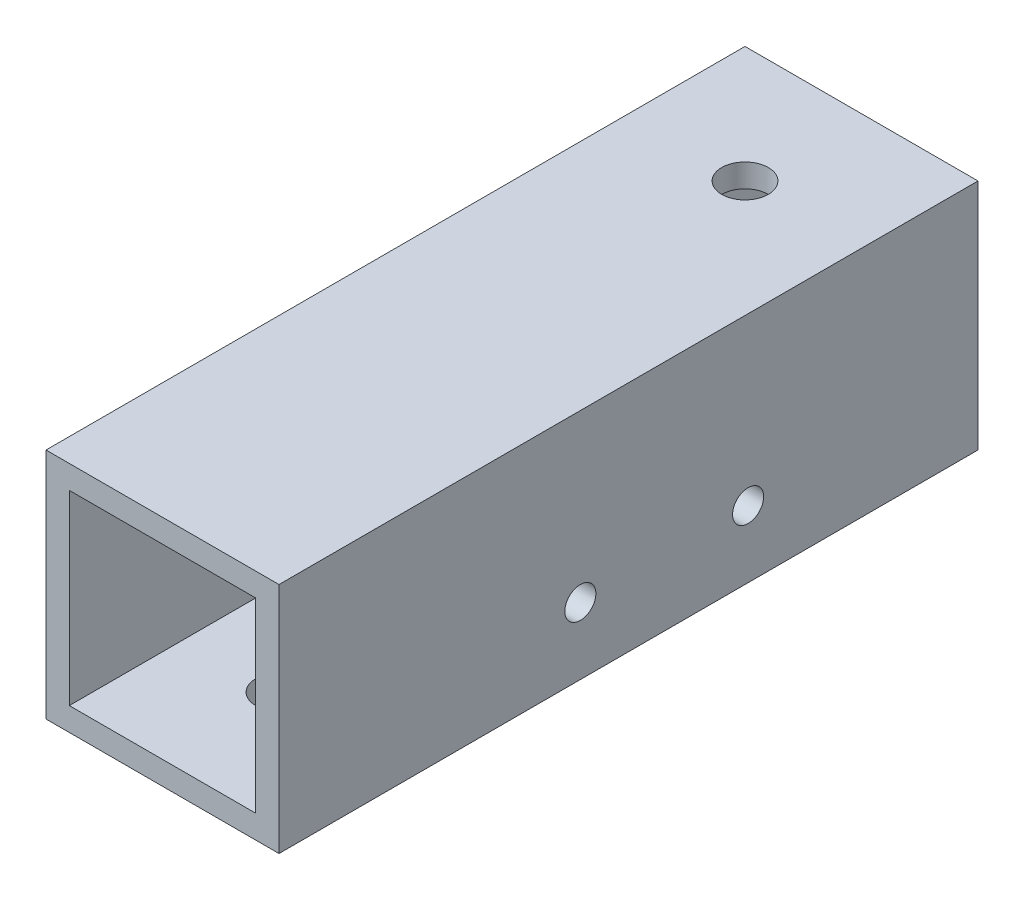
ISO-10303-21;
HEADER;
FILE_DESCRIPTION(('STEP AP214'),'2;1');
FILE_NAME('part.step','',(''),(''),'','','');
FILE_SCHEMA(('AUTOMOTIVE_DESIGN { 1 0 10303 214 1 1 1 1 }'));
ENDSEC;
DATA;
#1=APPLICATION_CONTEXT('core data for automotive mechanical design processes');
#2=APPLICATION_PROTOCOL_DEFINITION('international standard','automotive_design',2000,#1);
#3=PRODUCT_CONTEXT('',#1,'mechanical');
#4=PRODUCT('Part','Part','',(#3));
#5=PRODUCT_RELATED_PRODUCT_CATEGORY('part','',(#4));
#6=PRODUCT_DEFINITION_FORMATION('','',#4);
#7=PRODUCT_DEFINITION_CONTEXT('part definition',#1,'design');
#8=PRODUCT_DEFINITION('design','',#6,#7);
#9=PRODUCT_DEFINITION_SHAPE('','',#8);
#10=(LENGTH_UNIT() NAMED_UNIT(*) SI_UNIT(.MILLI.,.METRE.));
#11=(NAMED_UNIT(*) PLANE_ANGLE_UNIT() SI_UNIT($,.RADIAN.));
#12=(NAMED_UNIT(*) SI_UNIT($,.STERADIAN.) SOLID_ANGLE_UNIT());
#13=UNCERTAINTY_MEASURE_WITH_UNIT(LENGTH_MEASURE(1.E-05),#10,'distance_accuracy_value','');
#14=(GEOMETRIC_REPRESENTATION_CONTEXT(3) GLOBAL_UNCERTAINTY_ASSIGNED_CONTEXT((#13)) GLOBAL_UNIT_ASSIGNED_CONTEXT((#10,
#11,#12)) REPRESENTATION_CONTEXT('',''));
#15=CARTESIAN_POINT('',(0.,0.,0.));
#16=DIRECTION('',(0.,0.,1.));
#17=DIRECTION('',(1.,0.,0.));
#18=AXIS2_PLACEMENT_3D('',#15,#16,#17);
#19=CARTESIAN_POINT('',(0.,0.,45.));
#20=DIRECTION('',(0.,0.,1.));
#21=DIRECTION('',(1.,0.,0.));
#22=AXIS2_PLACEMENT_3D('',#19,#20,#21);
#23=PLANE('',#22);
#24=DIRECTION('',(0.,-1.,0.));
#25=VECTOR('',#24,1.);
#26=CARTESIAN_POINT('',(-7.01008414074451,7.73262608579252,45.));
#27=LINE('',#26,#25);
#28=CARTESIAN_POINT('',(-7.01008414074451,7.73262608579252,45.));
#29=VERTEX_POINT('',#28);
#30=CARTESIAN_POINT('',(-7.01008414074451,-7.26737391420748,45.));
#31=VERTEX_POINT('',#30);
#32=EDGE_CURVE('E138',#29,#31,#27,.T.);
#33=ORIENTED_EDGE('',*,*,#32,.T.);
#34=DIRECTION('',(1.,0.,0.));
#35=VECTOR('',#34,1.);
#36=CARTESIAN_POINT('',(-7.01008414074451,-7.26737391420748,45.));
#37=LINE('',#36,#35);
#38=CARTESIAN_POINT('',(7.98991585925548,-7.26737391420748,45.));
#39=VERTEX_POINT('',#38);
#40=EDGE_CURVE('E141',#31,#39,#37,.T.);
#41=ORIENTED_EDGE('',*,*,#40,.T.);
#42=DIRECTION('',(0.,1.,0.));
#43=VECTOR('',#42,1.);
#44=CARTESIAN_POINT('',(7.98991585925549,7.73262608579252,45.));
#45=LINE('',#44,#43);
#46=CARTESIAN_POINT('',(7.98991585925549,7.73262608579252,45.));
#47=VERTEX_POINT('',#46);
#48=EDGE_CURVE('E144',#39,#47,#45,.T.);
#49=ORIENTED_EDGE('',*,*,#48,.T.);
#50=DIRECTION('',(-1.,0.,0.));
#51=VECTOR('',#50,1.);
#52=CARTESIAN_POINT('',(-7.01008414074451,7.73262608579252,45.));
#53=LINE('',#52,#51);
#54=EDGE_CURVE('E146',#47,#29,#53,.T.);
#55=ORIENTED_EDGE('',*,*,#54,.T.);
#56=EDGE_LOOP('',(#33,#41,#49,#55));
#57=FACE_BOUND('',#56,.T.);
#58=DIRECTION('',(1.,0.,0.));
#59=VECTOR('',#58,1.);
#60=CARTESIAN_POINT('',(-5.51008414074451,-5.76737391420748,45.));
#61=LINE('',#60,#59);
#62=CARTESIAN_POINT('',(-5.51008414074451,-5.76737391420748,45.));
#63=VERTEX_POINT('',#62);
#64=CARTESIAN_POINT('',(6.48991585925549,-5.76737391420748,45.));
#65=VERTEX_POINT('',#64);
#66=EDGE_CURVE('E108',#63,#65,#61,.T.);
#67=ORIENTED_EDGE('',*,*,#66,.F.);
#68=DIRECTION('',(0.,-1.,0.));
#69=VECTOR('',#68,1.);
#70=CARTESIAN_POINT('',(-5.51008414074451,6.23262608579252,45.));
#71=LINE('',#70,#69);
#72=CARTESIAN_POINT('',(-5.51008414074451,6.23262608579252,45.));
#73=VERTEX_POINT('',#72);
#74=EDGE_CURVE('E100',#73,#63,#71,.T.);
#75=ORIENTED_EDGE('',*,*,#74,.F.);
#76=DIRECTION('',(-1.,0.,0.));
#77=VECTOR('',#76,1.);
#78=CARTESIAN_POINT('',(-5.51008414074451,6.23262608579252,45.));
#79=LINE('',#78,#77);
#80=CARTESIAN_POINT('',(6.48991585925549,6.23262608579252,45.));
#81=VERTEX_POINT('',#80);
#82=EDGE_CURVE('E122',#81,#73,#79,.T.);
#83=ORIENTED_EDGE('',*,*,#82,.F.);
#84=DIRECTION('',(0.,1.,0.));
#85=VECTOR('',#84,1.);
#86=CARTESIAN_POINT('',(6.48991585925549,6.23262608579252,45.));
#87=LINE('',#86,#85);
#88=EDGE_CURVE('E120',#65,#81,#87,.T.);
#89=ORIENTED_EDGE('',*,*,#88,.F.);
#90=EDGE_LOOP('',(#67,#75,#83,#89));
#91=FACE_BOUND('',#90,.T.);
#92=ADVANCED_FACE('F33',(#57,#91),#23,.T.);
#93=CARTESIAN_POINT('',(0.,0.,0.));
#94=DIRECTION('',(0.,0.,1.));
#95=DIRECTION('',(1.,0.,0.));
#96=AXIS2_PLACEMENT_3D('',#93,#94,#95);
#97=PLANE('',#96);
#98=DIRECTION('',(0.,-1.,0.));
#99=VECTOR('',#98,1.);
#100=CARTESIAN_POINT('',(-7.01008414074451,7.73262608579252,0.));
#101=LINE('',#100,#99);
#102=CARTESIAN_POINT('',(-7.01008414074451,7.73262608579252,0.));
#103=VERTEX_POINT('',#102);
#104=CARTESIAN_POINT('',(-7.01008414074451,-7.26737391420748,0.));
#105=VERTEX_POINT('',#104);
#106=EDGE_CURVE('E116',#103,#105,#101,.T.);
#107=ORIENTED_EDGE('',*,*,#106,.F.);
#108=DIRECTION('',(-1.,0.,0.));
#109=VECTOR('',#108,1.);
#110=CARTESIAN_POINT('',(-7.01008414074451,7.73262608579252,0.));
#111=LINE('',#110,#109);
#112=CARTESIAN_POINT('',(7.98991585925549,7.73262608579252,0.));
#113=VERTEX_POINT('',#112);
#114=EDGE_CURVE('E142',#113,#103,#111,.T.);
#115=ORIENTED_EDGE('',*,*,#114,.F.);
#116=DIRECTION('',(0.,1.,0.));
#117=VECTOR('',#116,1.);
#118=CARTESIAN_POINT('',(7.98991585925549,7.73262608579252,0.));
#119=LINE('',#118,#117);
#120=CARTESIAN_POINT('',(7.98991585925548,-7.26737391420748,0.));
#121=VERTEX_POINT('',#120);
#122=EDGE_CURVE('E153',#121,#113,#119,.T.);
#123=ORIENTED_EDGE('',*,*,#122,.F.);
#124=DIRECTION('',(1.,0.,0.));
#125=VECTOR('',#124,1.);
#126=CARTESIAN_POINT('',(-7.01008414074451,-7.26737391420748,0.));
#127=LINE('',#126,#125);
#128=EDGE_CURVE('E151',#105,#121,#127,.T.);
#129=ORIENTED_EDGE('',*,*,#128,.F.);
#130=EDGE_LOOP('',(#107,#115,#123,#129));
#131=FACE_BOUND('',#130,.T.);
#132=DIRECTION('',(0.,-1.,0.));
#133=VECTOR('',#132,1.);
#134=CARTESIAN_POINT('',(-5.51008414074451,6.23262608579252,0.));
#135=LINE('',#134,#133);
#136=CARTESIAN_POINT('',(-5.51008414074451,6.23262608579252,0.));
#137=VERTEX_POINT('',#136);
#138=CARTESIAN_POINT('',(-5.51008414074451,-5.76737391420748,0.));
#139=VERTEX_POINT('',#138);
#140=EDGE_CURVE('E58',#137,#139,#135,.T.);
#141=ORIENTED_EDGE('',*,*,#140,.T.);
#142=DIRECTION('',(1.,0.,0.));
#143=VECTOR('',#142,1.);
#144=CARTESIAN_POINT('',(-5.51008414074451,-5.76737391420748,0.));
#145=LINE('',#144,#143);
#146=CARTESIAN_POINT('',(6.48991585925549,-5.76737391420748,0.));
#147=VERTEX_POINT('',#146);
#148=EDGE_CURVE('E115',#139,#147,#145,.T.);
#149=ORIENTED_EDGE('',*,*,#148,.T.);
#150=DIRECTION('',(0.,1.,0.));
#151=VECTOR('',#150,1.);
#152=CARTESIAN_POINT('',(6.48991585925549,6.23262608579252,0.));
#153=LINE('',#152,#151);
#154=CARTESIAN_POINT('',(6.48991585925549,6.23262608579252,0.));
#155=VERTEX_POINT('',#154);
#156=EDGE_CURVE('E130',#147,#155,#153,.T.);
#157=ORIENTED_EDGE('',*,*,#156,.T.);
#158=DIRECTION('',(-1.,0.,0.));
#159=VECTOR('',#158,1.);
#160=CARTESIAN_POINT('',(-5.51008414074451,6.23262608579252,0.));
#161=LINE('',#160,#159);
#162=EDGE_CURVE('E109',#155,#137,#161,.T.);
#163=ORIENTED_EDGE('',*,*,#162,.T.);
#164=EDGE_LOOP('',(#141,#149,#157,#163));
#165=FACE_BOUND('',#164,.T.);
#166=ADVANCED_FACE('F203',(#131,#165),#97,.F.);
#167=CARTESIAN_POINT('',(-7.01008414074451,7.73262608579252,45.));
#168=DIRECTION('',(1.,0.,0.));
#169=DIRECTION('',(0.,1.,0.));
#170=AXIS2_PLACEMENT_3D('',#167,#168,#169);
#171=PLANE('',#170);
#172=ORIENTED_EDGE('',*,*,#106,.T.);
#173=DIRECTION('',(0.,0.,-1.));
#174=VECTOR('',#173,1.);
#175=CARTESIAN_POINT('',(-7.01008414074451,-7.26737391420748,45.));
#176=LINE('',#175,#174);
#177=EDGE_CURVE('E11',#31,#105,#176,.T.);
#178=ORIENTED_EDGE('',*,*,#177,.F.);
#179=ORIENTED_EDGE('',*,*,#32,.F.);
#180=DIRECTION('',(0.,0.,-1.));
#181=VECTOR('',#180,1.);
#182=CARTESIAN_POINT('',(-7.01008414074451,7.73262608579252,45.));
#183=LINE('',#182,#181);
#184=EDGE_CURVE('E148',#29,#103,#183,.T.);
#185=ORIENTED_EDGE('',*,*,#184,.T.);
#186=EDGE_LOOP('',(#172,#178,#179,#185));
#187=FACE_BOUND('',#186,.T.);
#188=ADVANCED_FACE('F35',(#187),#171,.F.);
#189=CARTESIAN_POINT('',(-7.01008414074451,-7.26737391420748,45.));
#190=DIRECTION('',(0.,1.,0.));
#191=DIRECTION('',(0.,0.,1.));
#192=AXIS2_PLACEMENT_3D('',#189,#190,#191);
#193=PLANE('',#192);
#194=CARTESIAN_POINT('',(0.489915859255484,-7.26737391420748,37.5));
#195=DIRECTION('',(0.,-1.,0.));
#196=DIRECTION('',(0.,0.,-1.));
#197=AXIS2_PLACEMENT_3D('',#194,#195,#196);
#198=CIRCLE('',#197,1.5);
#199=CARTESIAN_POINT('',(0.489915859255484,-7.26737391420748,36.));
#200=VERTEX_POINT('',#199);
#201=EDGE_CURVE('E168',#200,#200,#198,.T.);
#202=ORIENTED_EDGE('',*,*,#201,.F.);
#203=EDGE_LOOP('',(#202));
#204=FACE_BOUND('',#203,.T.);
#205=ORIENTED_EDGE('',*,*,#128,.T.);
#206=DIRECTION('',(0.,0.,-1.));
#207=VECTOR('',#206,1.);
#208=CARTESIAN_POINT('',(7.98991585925548,-7.26737391420748,45.));
#209=LINE('',#208,#207);
#210=EDGE_CURVE('E42',#39,#121,#209,.T.);
#211=ORIENTED_EDGE('',*,*,#210,.F.);
#212=ORIENTED_EDGE('',*,*,#40,.F.);
#213=ORIENTED_EDGE('',*,*,#177,.T.);
#214=EDGE_LOOP('',(#205,#211,#212,#213));
#215=FACE_BOUND('',#214,.T.);
#216=ADVANCED_FACE('F207',(#204,#215),#193,.F.);
#217=CARTESIAN_POINT('',(7.98991585925549,7.73262608579252,45.));
#218=DIRECTION('',(-1.,0.,0.));
#219=DIRECTION('',(0.,-1.,0.));
#220=AXIS2_PLACEMENT_3D('',#217,#218,#219);
#221=PLANE('',#220);
#222=CARTESIAN_POINT('',(7.98991585925548,-2.96737391420748,14.8));
#223=DIRECTION('',(1.,0.,0.));
#224=DIRECTION('',(0.,1.,0.));
#225=AXIS2_PLACEMENT_3D('',#222,#223,#224);
#226=CIRCLE('',#225,1.);
#227=CARTESIAN_POINT('',(7.98991585925548,-1.96737391420748,14.8));
#228=VERTEX_POINT('',#227);
#229=EDGE_CURVE('E181',#228,#228,#226,.T.);
#230=ORIENTED_EDGE('',*,*,#229,.F.);
#231=EDGE_LOOP('',(#230));
#232=FACE_BOUND('',#231,.T.);
#233=CARTESIAN_POINT('',(7.98991585925548,-2.96737391420748,25.6));
#234=DIRECTION('',(1.,0.,0.));
#235=DIRECTION('',(0.,1.,0.));
#236=AXIS2_PLACEMENT_3D('',#233,#234,#235);
#237=CIRCLE('',#236,0.999999999999998);
#238=CARTESIAN_POINT('',(7.98991585925548,-1.96737391420748,25.6));
#239=VERTEX_POINT('',#238);
#240=EDGE_CURVE('E171',#239,#239,#237,.T.);
#241=ORIENTED_EDGE('',*,*,#240,.F.);
#242=EDGE_LOOP('',(#241));
#243=FACE_BOUND('',#242,.T.);
#244=ORIENTED_EDGE('',*,*,#122,.T.);
#245=DIRECTION('',(0.,0.,-1.));
#246=VECTOR('',#245,1.);
#247=CARTESIAN_POINT('',(7.98991585925549,7.73262608579252,45.));
#248=LINE('',#247,#246);
#249=EDGE_CURVE('E158',#47,#113,#248,.T.);
#250=ORIENTED_EDGE('',*,*,#249,.F.);
#251=ORIENTED_EDGE('',*,*,#48,.F.);
#252=ORIENTED_EDGE('',*,*,#210,.T.);
#253=EDGE_LOOP('',(#244,#250,#251,#252));
#254=FACE_BOUND('',#253,.T.);
#255=ADVANCED_FACE('F191',(#232,#243,#254),#221,.F.);
#256=CARTESIAN_POINT('',(-7.01008414074451,7.73262608579252,45.));
#257=DIRECTION('',(0.,-1.,0.));
#258=DIRECTION('',(0.,0.,-1.));
#259=AXIS2_PLACEMENT_3D('',#256,#257,#258);
#260=PLANE('',#259);
#261=CARTESIAN_POINT('',(0.489915859255487,7.73262608579252,7.5));
#262=DIRECTION('',(0.,1.,0.));
#263=DIRECTION('',(0.,0.,1.));
#264=AXIS2_PLACEMENT_3D('',#261,#262,#263);
#265=CIRCLE('',#264,1.5);
#266=CARTESIAN_POINT('',(0.489915859255487,7.73262608579252,9.));
#267=VERTEX_POINT('',#266);
#268=EDGE_CURVE('E165',#267,#267,#265,.T.);
#269=ORIENTED_EDGE('',*,*,#268,.F.);
#270=EDGE_LOOP('',(#269));
#271=FACE_BOUND('',#270,.T.);
#272=ORIENTED_EDGE('',*,*,#114,.T.);
#273=ORIENTED_EDGE('',*,*,#184,.F.);
#274=ORIENTED_EDGE('',*,*,#54,.F.);
#275=ORIENTED_EDGE('',*,*,#249,.T.);
#276=EDGE_LOOP('',(#272,#273,#274,#275));
#277=FACE_BOUND('',#276,.T.);
#278=ADVANCED_FACE('F188',(#271,#277),#260,.F.);
#279=CARTESIAN_POINT('',(-5.51008414074451,6.23262608579252,45.));
#280=DIRECTION('',(1.,0.,0.));
#281=DIRECTION('',(0.,1.,0.));
#282=AXIS2_PLACEMENT_3D('',#279,#280,#281);
#283=PLANE('',#282);
#284=ORIENTED_EDGE('',*,*,#140,.F.);
#285=DIRECTION('',(0.,0.,-1.));
#286=VECTOR('',#285,1.);
#287=CARTESIAN_POINT('',(-5.51008414074451,6.23262608579252,45.));
#288=LINE('',#287,#286);
#289=EDGE_CURVE('E104',#73,#137,#288,.T.);
#290=ORIENTED_EDGE('',*,*,#289,.F.);
#291=ORIENTED_EDGE('',*,*,#74,.T.);
#292=DIRECTION('',(0.,0.,-1.));
#293=VECTOR('',#292,1.);
#294=CARTESIAN_POINT('',(-5.51008414074451,-5.76737391420748,45.));
#295=LINE('',#294,#293);
#296=EDGE_CURVE('E103',#63,#139,#295,.T.);
#297=ORIENTED_EDGE('',*,*,#296,.T.);
#298=EDGE_LOOP('',(#284,#290,#291,#297));
#299=FACE_BOUND('',#298,.T.);
#300=ADVANCED_FACE('F102',(#299),#283,.T.);
#301=CARTESIAN_POINT('',(-5.51008414074451,-5.76737391420748,45.));
#302=DIRECTION('',(0.,1.,0.));
#303=DIRECTION('',(0.,0.,1.));
#304=AXIS2_PLACEMENT_3D('',#301,#302,#303);
#305=PLANE('',#304);
#306=CARTESIAN_POINT('',(0.489915859255484,-5.76737391420748,37.5));
#307=DIRECTION('',(0.,1.,0.));
#308=DIRECTION('',(0.,0.,1.));
#309=AXIS2_PLACEMENT_3D('',#306,#307,#308);
#310=CIRCLE('',#309,1.5);
#311=CARTESIAN_POINT('',(0.489915859255484,-5.76737391420748,39.));
#312=VERTEX_POINT('',#311);
#313=EDGE_CURVE('E166',#312,#312,#310,.T.);
#314=ORIENTED_EDGE('',*,*,#313,.F.);
#315=EDGE_LOOP('',(#314));
#316=FACE_BOUND('',#315,.T.);
#317=ORIENTED_EDGE('',*,*,#148,.F.);
#318=ORIENTED_EDGE('',*,*,#296,.F.);
#319=ORIENTED_EDGE('',*,*,#66,.T.);
#320=DIRECTION('',(0.,0.,-1.));
#321=VECTOR('',#320,1.);
#322=CARTESIAN_POINT('',(6.48991585925549,-5.76737391420748,45.));
#323=LINE('',#322,#321);
#324=EDGE_CURVE('E117',#65,#147,#323,.T.);
#325=ORIENTED_EDGE('',*,*,#324,.T.);
#326=EDGE_LOOP('',(#317,#318,#319,#325));
#327=FACE_BOUND('',#326,.T.);
#328=ADVANCED_FACE('F112',(#316,#327),#305,.T.);
#329=CARTESIAN_POINT('',(6.48991585925549,6.23262608579252,45.));
#330=DIRECTION('',(-1.,0.,0.));
#331=DIRECTION('',(0.,-1.,0.));
#332=AXIS2_PLACEMENT_3D('',#329,#330,#331);
#333=PLANE('',#332);
#334=CARTESIAN_POINT('',(6.48991585925549,-2.96737391420748,14.8));
#335=DIRECTION('',(-1.,0.,0.));
#336=DIRECTION('',(0.,-1.,0.));
#337=AXIS2_PLACEMENT_3D('',#334,#335,#336);
#338=CIRCLE('',#337,1.);
#339=CARTESIAN_POINT('',(6.48991585925549,-3.96737391420748,14.8));
#340=VERTEX_POINT('',#339);
#341=EDGE_CURVE('E37',#340,#340,#338,.T.);
#342=ORIENTED_EDGE('',*,*,#341,.F.);
#343=EDGE_LOOP('',(#342));
#344=FACE_BOUND('',#343,.T.);
#345=CARTESIAN_POINT('',(6.48991585925549,-2.96737391420748,25.6));
#346=DIRECTION('',(-1.,0.,0.));
#347=DIRECTION('',(0.,-1.,0.));
#348=AXIS2_PLACEMENT_3D('',#345,#346,#347);
#349=CIRCLE('',#348,0.999999999999998);
#350=CARTESIAN_POINT('',(6.48991585925549,-3.96737391420748,25.6));
#351=VERTEX_POINT('',#350);
#352=EDGE_CURVE('E169',#351,#351,#349,.T.);
#353=ORIENTED_EDGE('',*,*,#352,.F.);
#354=EDGE_LOOP('',(#353));
#355=FACE_BOUND('',#354,.T.);
#356=ORIENTED_EDGE('',*,*,#156,.F.);
#357=ORIENTED_EDGE('',*,*,#324,.F.);
#358=ORIENTED_EDGE('',*,*,#88,.T.);
#359=DIRECTION('',(0.,0.,-1.));
#360=VECTOR('',#359,1.);
#361=CARTESIAN_POINT('',(6.48991585925549,6.23262608579252,45.));
#362=LINE('',#361,#360);
#363=EDGE_CURVE('E50',#81,#155,#362,.T.);
#364=ORIENTED_EDGE('',*,*,#363,.T.);
#365=EDGE_LOOP('',(#356,#357,#358,#364));
#366=FACE_BOUND('',#365,.T.);
#367=ADVANCED_FACE('F231',(#344,#355,#366),#333,.T.);
#368=CARTESIAN_POINT('',(-5.51008414074451,6.23262608579252,45.));
#369=DIRECTION('',(0.,-1.,0.));
#370=DIRECTION('',(0.,0.,-1.));
#371=AXIS2_PLACEMENT_3D('',#368,#369,#370);
#372=PLANE('',#371);
#373=CARTESIAN_POINT('',(0.489915859255487,6.23262608579252,7.5));
#374=DIRECTION('',(0.,-1.,0.));
#375=DIRECTION('',(0.,0.,-1.));
#376=AXIS2_PLACEMENT_3D('',#373,#374,#375);
#377=CIRCLE('',#376,1.5);
#378=CARTESIAN_POINT('',(0.489915859255487,6.23262608579252,6.));
#379=VERTEX_POINT('',#378);
#380=EDGE_CURVE('E128',#379,#379,#377,.T.);
#381=ORIENTED_EDGE('',*,*,#380,.F.);
#382=EDGE_LOOP('',(#381));
#383=FACE_BOUND('',#382,.T.);
#384=ORIENTED_EDGE('',*,*,#162,.F.);
#385=ORIENTED_EDGE('',*,*,#363,.F.);
#386=ORIENTED_EDGE('',*,*,#82,.T.);
#387=ORIENTED_EDGE('',*,*,#289,.T.);
#388=EDGE_LOOP('',(#384,#385,#386,#387));
#389=FACE_BOUND('',#388,.T.);
#390=ADVANCED_FACE('F235',(#383,#389),#372,.T.);
#391=CARTESIAN_POINT('',(0.489915859255487,-2.26737391420748,7.5));
#392=DIRECTION('',(0.,1.,0.));
#393=DIRECTION('',(0.,0.,1.));
#394=AXIS2_PLACEMENT_3D('',#391,#392,#393);
#395=CYLINDRICAL_SURFACE('',#394,1.5);
#396=ORIENTED_EDGE('',*,*,#380,.T.);
#397=EDGE_LOOP('',(#396));
#398=FACE_BOUND('',#397,.T.);
#399=ORIENTED_EDGE('',*,*,#268,.T.);
#400=EDGE_LOOP('',(#399));
#401=FACE_BOUND('',#400,.T.);
#402=ADVANCED_FACE('F186',(#398,#401),#395,.F.);
#403=CARTESIAN_POINT('',(0.489915859255484,2.73262608579252,37.5));
#404=DIRECTION('',(0.,-1.,0.));
#405=DIRECTION('',(0.,0.,-1.));
#406=AXIS2_PLACEMENT_3D('',#403,#404,#405);
#407=CYLINDRICAL_SURFACE('',#406,1.5);
#408=ORIENTED_EDGE('',*,*,#313,.T.);
#409=EDGE_LOOP('',(#408));
#410=FACE_BOUND('',#409,.T.);
#411=ORIENTED_EDGE('',*,*,#201,.T.);
#412=EDGE_LOOP('',(#411));
#413=FACE_BOUND('',#412,.T.);
#414=ADVANCED_FACE('F242',(#410,#413),#407,.F.);
#415=CARTESIAN_POINT('',(-2.01008414074452,-2.96737391420748,25.6));
#416=DIRECTION('',(1.,0.,0.));
#417=DIRECTION('',(0.,1.,0.));
#418=AXIS2_PLACEMENT_3D('',#415,#416,#417);
#419=CYLINDRICAL_SURFACE('',#418,0.999999999999998);
#420=ORIENTED_EDGE('',*,*,#352,.T.);
#421=EDGE_LOOP('',(#420));
#422=FACE_BOUND('',#421,.T.);
#423=ORIENTED_EDGE('',*,*,#240,.T.);
#424=EDGE_LOOP('',(#423));
#425=FACE_BOUND('',#424,.T.);
#426=ADVANCED_FACE('F246',(#422,#425),#419,.F.);
#427=CARTESIAN_POINT('',(-2.01008414074452,-2.96737391420748,14.8));
#428=DIRECTION('',(1.,0.,0.));
#429=DIRECTION('',(0.,1.,0.));
#430=AXIS2_PLACEMENT_3D('',#427,#428,#429);
#431=CYLINDRICAL_SURFACE('',#430,1.);
#432=ORIENTED_EDGE('',*,*,#341,.T.);
#433=EDGE_LOOP('',(#432));
#434=FACE_BOUND('',#433,.T.);
#435=ORIENTED_EDGE('',*,*,#229,.T.);
#436=EDGE_LOOP('',(#435));
#437=FACE_BOUND('',#436,.T.);
#438=ADVANCED_FACE('F250',(#434,#437),#431,.F.);
#439=CLOSED_SHELL('',(#92,#166,#188,#216,#255,#278,#300,#328,#367,#390,#402,#414,#426,#438));
#440=MANIFOLD_SOLID_BREP('B2',#439);
#441=ADVANCED_BREP_SHAPE_REPRESENTATION('',(#18,#440),#14);
#442=SHAPE_DEFINITION_REPRESENTATION(#9,#441);
ENDSEC;
END-ISO-10303-21;
